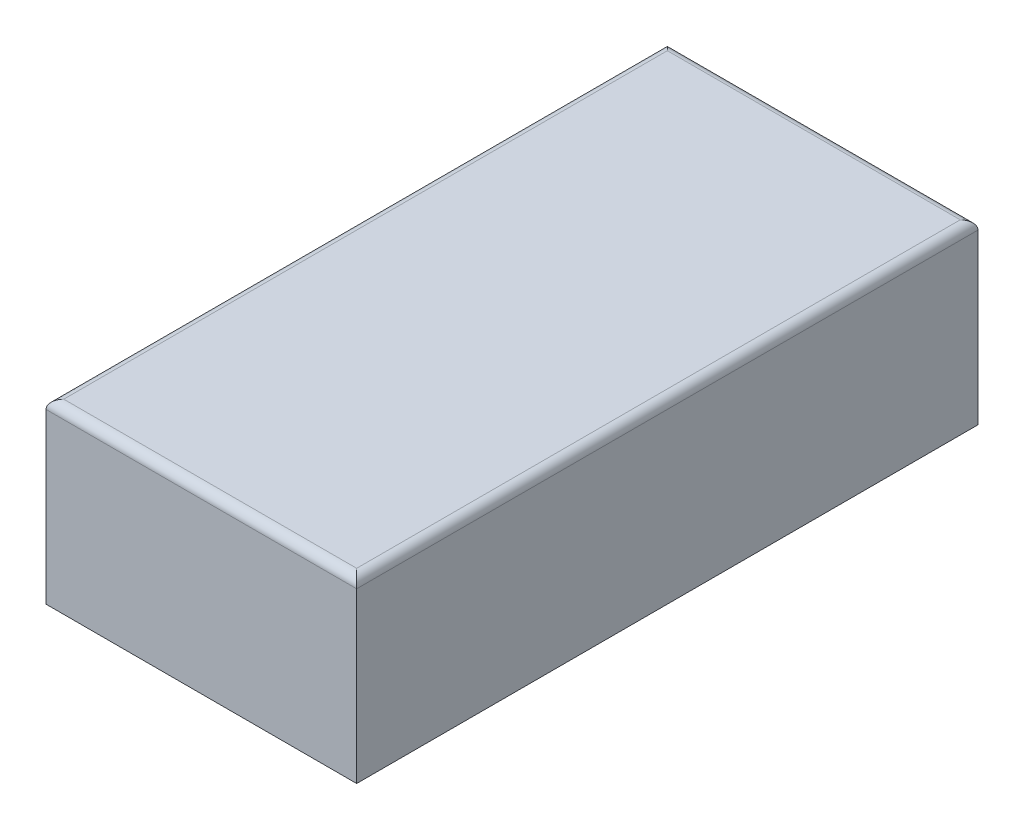
ISO-10303-21;
HEADER;
FILE_DESCRIPTION(('STEP AP214'),'2;1');
FILE_NAME('part.step','',(''),(''),'','','');
FILE_SCHEMA(('AUTOMOTIVE_DESIGN { 1 0 10303 214 1 1 1 1 }'));
ENDSEC;
DATA;
#1=APPLICATION_CONTEXT('core data for automotive mechanical design processes');
#2=APPLICATION_PROTOCOL_DEFINITION('international standard','automotive_design',2000,#1);
#3=PRODUCT_CONTEXT('',#1,'mechanical');
#4=PRODUCT('Part','Part','',(#3));
#5=PRODUCT_RELATED_PRODUCT_CATEGORY('part','',(#4));
#6=PRODUCT_DEFINITION_FORMATION('','',#4);
#7=PRODUCT_DEFINITION_CONTEXT('part definition',#1,'design');
#8=PRODUCT_DEFINITION('design','',#6,#7);
#9=PRODUCT_DEFINITION_SHAPE('','',#8);
#10=(LENGTH_UNIT() NAMED_UNIT(*) SI_UNIT(.MILLI.,.METRE.));
#11=(NAMED_UNIT(*) PLANE_ANGLE_UNIT() SI_UNIT($,.RADIAN.));
#12=(NAMED_UNIT(*) SI_UNIT($,.STERADIAN.) SOLID_ANGLE_UNIT());
#13=UNCERTAINTY_MEASURE_WITH_UNIT(LENGTH_MEASURE(1.E-05),#10,'distance_accuracy_value','');
#14=(GEOMETRIC_REPRESENTATION_CONTEXT(3) GLOBAL_UNCERTAINTY_ASSIGNED_CONTEXT((#13)) GLOBAL_UNIT_ASSIGNED_CONTEXT((#10,
#11,#12)) REPRESENTATION_CONTEXT('',''));
#15=CARTESIAN_POINT('',(0.,0.,0.));
#16=DIRECTION('',(0.,0.,1.));
#17=DIRECTION('',(1.,0.,0.));
#18=AXIS2_PLACEMENT_3D('',#15,#16,#17);
#19=CARTESIAN_POINT('',(0.,2.,0.));
#20=DIRECTION('',(1.,0.,0.));
#21=DIRECTION('',(0.,0.,-1.));
#22=AXIS2_PLACEMENT_3D('',#19,#20,#21);
#23=PLANE('',#22);
#24=DIRECTION('',(0.,-1.,0.));
#25=VECTOR('',#24,1.);
#26=CARTESIAN_POINT('',(0.,2.,0.));
#27=LINE('',#26,#25);
#28=CARTESIAN_POINT('',(0.,1.9,0.));
#29=VERTEX_POINT('',#28);
#30=CARTESIAN_POINT('',(0.,0.,0.));
#31=VERTEX_POINT('',#30);
#32=EDGE_CURVE('E86',#29,#31,#27,.T.);
#33=ORIENTED_EDGE('',*,*,#32,.F.);
#34=DIRECTION('',(0.,0.,1.));
#35=VECTOR('',#34,1.);
#36=CARTESIAN_POINT('',(0.,1.9,0.));
#37=LINE('',#36,#35);
#38=CARTESIAN_POINT('',(0.,1.9,-7.));
#39=VERTEX_POINT('',#38);
#40=EDGE_CURVE('E11',#29,#39,#37,.F.);
#41=ORIENTED_EDGE('',*,*,#40,.T.);
#42=DIRECTION('',(0.,-1.,0.));
#43=VECTOR('',#42,1.);
#44=CARTESIAN_POINT('',(0.,2.,-7.));
#45=LINE('',#44,#43);
#46=CARTESIAN_POINT('',(0.,0.,-7.));
#47=VERTEX_POINT('',#46);
#48=EDGE_CURVE('E106',#39,#47,#45,.T.);
#49=ORIENTED_EDGE('',*,*,#48,.T.);
#50=DIRECTION('',(0.,0.,1.));
#51=VECTOR('',#50,1.);
#52=CARTESIAN_POINT('',(0.,0.,0.));
#53=LINE('',#52,#51);
#54=EDGE_CURVE('E101',#47,#31,#53,.T.);
#55=ORIENTED_EDGE('',*,*,#54,.T.);
#56=EDGE_LOOP('',(#33,#41,#49,#55));
#57=FACE_BOUND('',#56,.T.);
#58=ADVANCED_FACE('F34',(#57),#23,.F.);
#59=CARTESIAN_POINT('',(0.,2.,0.));
#60=DIRECTION('',(0.,0.,-1.));
#61=DIRECTION('',(-1.,0.,0.));
#62=AXIS2_PLACEMENT_3D('',#59,#60,#61);
#63=PLANE('',#62);
#64=DIRECTION('',(0.,-1.,0.));
#65=VECTOR('',#64,1.);
#66=CARTESIAN_POINT('',(3.5,2.,0.));
#67=LINE('',#66,#65);
#68=CARTESIAN_POINT('',(3.5,1.9,0.));
#69=VERTEX_POINT('',#68);
#70=CARTESIAN_POINT('',(3.5,0.,0.));
#71=VERTEX_POINT('',#70);
#72=EDGE_CURVE('E95',#69,#71,#67,.T.);
#73=ORIENTED_EDGE('',*,*,#72,.F.);
#74=DIRECTION('',(1.,0.,0.));
#75=VECTOR('',#74,1.);
#76=CARTESIAN_POINT('',(0.,1.9,0.));
#77=LINE('',#76,#75);
#78=EDGE_CURVE('E43',#69,#29,#77,.F.);
#79=ORIENTED_EDGE('',*,*,#78,.T.);
#80=ORIENTED_EDGE('',*,*,#32,.T.);
#81=DIRECTION('',(1.,0.,0.));
#82=VECTOR('',#81,1.);
#83=CARTESIAN_POINT('',(0.,0.,0.));
#84=LINE('',#83,#82);
#85=EDGE_CURVE('E89',#31,#71,#84,.T.);
#86=ORIENTED_EDGE('',*,*,#85,.T.);
#87=EDGE_LOOP('',(#73,#79,#80,#86));
#88=FACE_BOUND('',#87,.T.);
#89=ADVANCED_FACE('F88',(#88),#63,.F.);
#90=CARTESIAN_POINT('',(3.5,2.,0.));
#91=DIRECTION('',(-1.,0.,0.));
#92=DIRECTION('',(0.,0.,1.));
#93=AXIS2_PLACEMENT_3D('',#90,#91,#92);
#94=PLANE('',#93);
#95=DIRECTION('',(0.,-1.,0.));
#96=VECTOR('',#95,1.);
#97=CARTESIAN_POINT('',(3.5,2.,-7.));
#98=LINE('',#97,#96);
#99=CARTESIAN_POINT('',(3.5,1.9,-7.));
#100=VERTEX_POINT('',#99);
#101=CARTESIAN_POINT('',(3.5,0.,-7.));
#102=VERTEX_POINT('',#101);
#103=EDGE_CURVE('E116',#100,#102,#98,.T.);
#104=ORIENTED_EDGE('',*,*,#103,.F.);
#105=DIRECTION('',(0.,0.,-1.));
#106=VECTOR('',#105,1.);
#107=CARTESIAN_POINT('',(3.5,1.9,0.));
#108=LINE('',#107,#106);
#109=EDGE_CURVE('E58',#100,#69,#108,.F.);
#110=ORIENTED_EDGE('',*,*,#109,.T.);
#111=ORIENTED_EDGE('',*,*,#72,.T.);
#112=DIRECTION('',(0.,0.,-1.));
#113=VECTOR('',#112,1.);
#114=CARTESIAN_POINT('',(3.5,0.,0.));
#115=LINE('',#114,#113);
#116=EDGE_CURVE('E103',#71,#102,#115,.T.);
#117=ORIENTED_EDGE('',*,*,#116,.T.);
#118=EDGE_LOOP('',(#104,#110,#111,#117));
#119=FACE_BOUND('',#118,.T.);
#120=ADVANCED_FACE('F154',(#119),#94,.F.);
#121=CARTESIAN_POINT('',(0.,2.,-7.));
#122=DIRECTION('',(0.,0.,1.));
#123=DIRECTION('',(1.,0.,0.));
#124=AXIS2_PLACEMENT_3D('',#121,#122,#123);
#125=PLANE('',#124);
#126=ORIENTED_EDGE('',*,*,#48,.F.);
#127=DIRECTION('',(-1.,0.,0.));
#128=VECTOR('',#127,1.);
#129=CARTESIAN_POINT('',(0.,1.9,-7.));
#130=LINE('',#129,#128);
#131=EDGE_CURVE('E127',#39,#100,#130,.F.);
#132=ORIENTED_EDGE('',*,*,#131,.T.);
#133=ORIENTED_EDGE('',*,*,#103,.T.);
#134=DIRECTION('',(-1.,0.,0.));
#135=VECTOR('',#134,1.);
#136=CARTESIAN_POINT('',(0.,0.,-7.));
#137=LINE('',#136,#135);
#138=EDGE_CURVE('E113',#102,#47,#137,.T.);
#139=ORIENTED_EDGE('',*,*,#138,.T.);
#140=EDGE_LOOP('',(#126,#132,#133,#139));
#141=FACE_BOUND('',#140,.T.);
#142=ADVANCED_FACE('F153',(#141),#125,.F.);
#143=CARTESIAN_POINT('',(0.,2.,0.));
#144=DIRECTION('',(0.,-1.,0.));
#145=DIRECTION('',(0.,0.,-1.));
#146=AXIS2_PLACEMENT_3D('',#143,#144,#145);
#147=PLANE('',#146);
#148=DIRECTION('',(0.,0.,-1.));
#149=VECTOR('',#148,1.);
#150=CARTESIAN_POINT('',(3.4,2.,0.));
#151=LINE('',#150,#149);
#152=CARTESIAN_POINT('',(3.4,2.,-0.1));
#153=VERTEX_POINT('',#152);
#154=CARTESIAN_POINT('',(3.4,2.,-6.9));
#155=VERTEX_POINT('',#154);
#156=EDGE_CURVE('E122',#153,#155,#151,.T.);
#157=ORIENTED_EDGE('',*,*,#156,.T.);
#158=DIRECTION('',(-1.,0.,0.));
#159=VECTOR('',#158,1.);
#160=CARTESIAN_POINT('',(0.,2.,-6.9));
#161=LINE('',#160,#159);
#162=CARTESIAN_POINT('',(0.1,2.,-6.9));
#163=VERTEX_POINT('',#162);
#164=EDGE_CURVE('E124',#155,#163,#161,.T.);
#165=ORIENTED_EDGE('',*,*,#164,.T.);
#166=DIRECTION('',(0.,0.,1.));
#167=VECTOR('',#166,1.);
#168=CARTESIAN_POINT('',(0.1,2.,0.));
#169=LINE('',#168,#167);
#170=CARTESIAN_POINT('',(0.1,2.,-0.1));
#171=VERTEX_POINT('',#170);
#172=EDGE_CURVE('E94',#163,#171,#169,.T.);
#173=ORIENTED_EDGE('',*,*,#172,.T.);
#174=DIRECTION('',(1.,0.,0.));
#175=VECTOR('',#174,1.);
#176=CARTESIAN_POINT('',(0.,2.,-0.1));
#177=LINE('',#176,#175);
#178=EDGE_CURVE('E120',#171,#153,#177,.T.);
#179=ORIENTED_EDGE('',*,*,#178,.T.);
#180=EDGE_LOOP('',(#157,#165,#173,#179));
#181=FACE_BOUND('',#180,.T.);
#182=ADVANCED_FACE('F146',(#181),#147,.F.);
#183=CARTESIAN_POINT('',(0.,0.,0.));
#184=DIRECTION('',(0.,-1.,0.));
#185=DIRECTION('',(0.,0.,-1.));
#186=AXIS2_PLACEMENT_3D('',#183,#184,#185);
#187=PLANE('',#186);
#188=ORIENTED_EDGE('',*,*,#54,.F.);
#189=ORIENTED_EDGE('',*,*,#138,.F.);
#190=ORIENTED_EDGE('',*,*,#116,.F.);
#191=ORIENTED_EDGE('',*,*,#85,.F.);
#192=EDGE_LOOP('',(#188,#189,#190,#191));
#193=FACE_BOUND('',#192,.T.);
#194=ADVANCED_FACE('F99',(#193),#187,.T.);
#195=CARTESIAN_POINT('',(0.,1.9,-0.1));
#196=DIRECTION('',(1.,0.,0.));
#197=DIRECTION('',(0.,0.,-1.));
#198=AXIS2_PLACEMENT_3D('',#195,#196,#197);
#199=CYLINDRICAL_SURFACE('',#198,0.1);
#200=CARTESIAN_POINT('',(0.1,1.9,-0.1));
#201=DIRECTION('',(0.707106781186547,0.,0.707106781186547));
#202=DIRECTION('',(-0.707106781186547,0.,0.707106781186547));
#203=AXIS2_PLACEMENT_3D('',#200,#201,#202);
#204=ELLIPSE('',#203,0.14142135623731,0.1);
#205=EDGE_CURVE('E110',#29,#171,#204,.F.);
#206=ORIENTED_EDGE('',*,*,#205,.F.);
#207=ORIENTED_EDGE('',*,*,#78,.F.);
#208=CARTESIAN_POINT('',(3.4,1.9,-0.1));
#209=DIRECTION('',(0.707106781186547,0.,-0.707106781186547));
#210=DIRECTION('',(0.707106781186547,0.,0.707106781186547));
#211=AXIS2_PLACEMENT_3D('',#208,#209,#210);
#212=ELLIPSE('',#211,0.14142135623731,0.1);
#213=EDGE_CURVE('E38',#153,#69,#212,.T.);
#214=ORIENTED_EDGE('',*,*,#213,.F.);
#215=ORIENTED_EDGE('',*,*,#178,.F.);
#216=EDGE_LOOP('',(#206,#207,#214,#215));
#217=FACE_BOUND('',#216,.T.);
#218=ADVANCED_FACE('F36',(#217),#199,.T.);
#219=CARTESIAN_POINT('',(3.4,1.9,0.));
#220=DIRECTION('',(0.,0.,-1.));
#221=DIRECTION('',(-1.,0.,0.));
#222=AXIS2_PLACEMENT_3D('',#219,#220,#221);
#223=CYLINDRICAL_SURFACE('',#222,0.1);
#224=ORIENTED_EDGE('',*,*,#213,.T.);
#225=ORIENTED_EDGE('',*,*,#109,.F.);
#226=CARTESIAN_POINT('',(3.4,1.9,-6.9));
#227=DIRECTION('',(-0.707106781186548,0.,-0.707106781186547));
#228=DIRECTION('',(0.707106781186547,0.,-0.707106781186548));
#229=AXIS2_PLACEMENT_3D('',#226,#227,#228);
#230=ELLIPSE('',#229,0.14142135623731,0.1);
#231=EDGE_CURVE('E134',#155,#100,#230,.T.);
#232=ORIENTED_EDGE('',*,*,#231,.F.);
#233=ORIENTED_EDGE('',*,*,#156,.F.);
#234=EDGE_LOOP('',(#224,#225,#232,#233));
#235=FACE_BOUND('',#234,.T.);
#236=ADVANCED_FACE('F171',(#235),#223,.T.);
#237=CARTESIAN_POINT('',(0.1,1.9,0.));
#238=DIRECTION('',(0.,0.,1.));
#239=DIRECTION('',(1.,0.,0.));
#240=AXIS2_PLACEMENT_3D('',#237,#238,#239);
#241=CYLINDRICAL_SURFACE('',#240,0.1);
#242=ORIENTED_EDGE('',*,*,#205,.T.);
#243=ORIENTED_EDGE('',*,*,#172,.F.);
#244=CARTESIAN_POINT('',(0.1,1.9,-6.9));
#245=DIRECTION('',(-0.707106781186547,0.,0.707106781186548));
#246=DIRECTION('',(0.707106781186548,0.,0.707106781186547));
#247=AXIS2_PLACEMENT_3D('',#244,#245,#246);
#248=ELLIPSE('',#247,0.14142135623731,0.1);
#249=EDGE_CURVE('E132',#39,#163,#248,.F.);
#250=ORIENTED_EDGE('',*,*,#249,.F.);
#251=ORIENTED_EDGE('',*,*,#40,.F.);
#252=EDGE_LOOP('',(#242,#243,#250,#251));
#253=FACE_BOUND('',#252,.T.);
#254=ADVANCED_FACE('F139',(#253),#241,.T.);
#255=CARTESIAN_POINT('',(0.,1.9,-6.9));
#256=DIRECTION('',(-1.,0.,0.));
#257=DIRECTION('',(0.,0.,1.));
#258=AXIS2_PLACEMENT_3D('',#255,#256,#257);
#259=CYLINDRICAL_SURFACE('',#258,0.1);
#260=ORIENTED_EDGE('',*,*,#231,.T.);
#261=ORIENTED_EDGE('',*,*,#131,.F.);
#262=ORIENTED_EDGE('',*,*,#249,.T.);
#263=ORIENTED_EDGE('',*,*,#164,.F.);
#264=EDGE_LOOP('',(#260,#261,#262,#263));
#265=FACE_BOUND('',#264,.T.);
#266=ADVANCED_FACE('F150',(#265),#259,.T.);
#267=CLOSED_SHELL('',(#58,#89,#120,#142,#182,#194,#218,#236,#254,#266));
#268=MANIFOLD_SOLID_BREP('B2',#267);
#269=ADVANCED_BREP_SHAPE_REPRESENTATION('',(#18,#268),#14);
#270=SHAPE_DEFINITION_REPRESENTATION(#9,#269);
ENDSEC;
END-ISO-10303-21;
